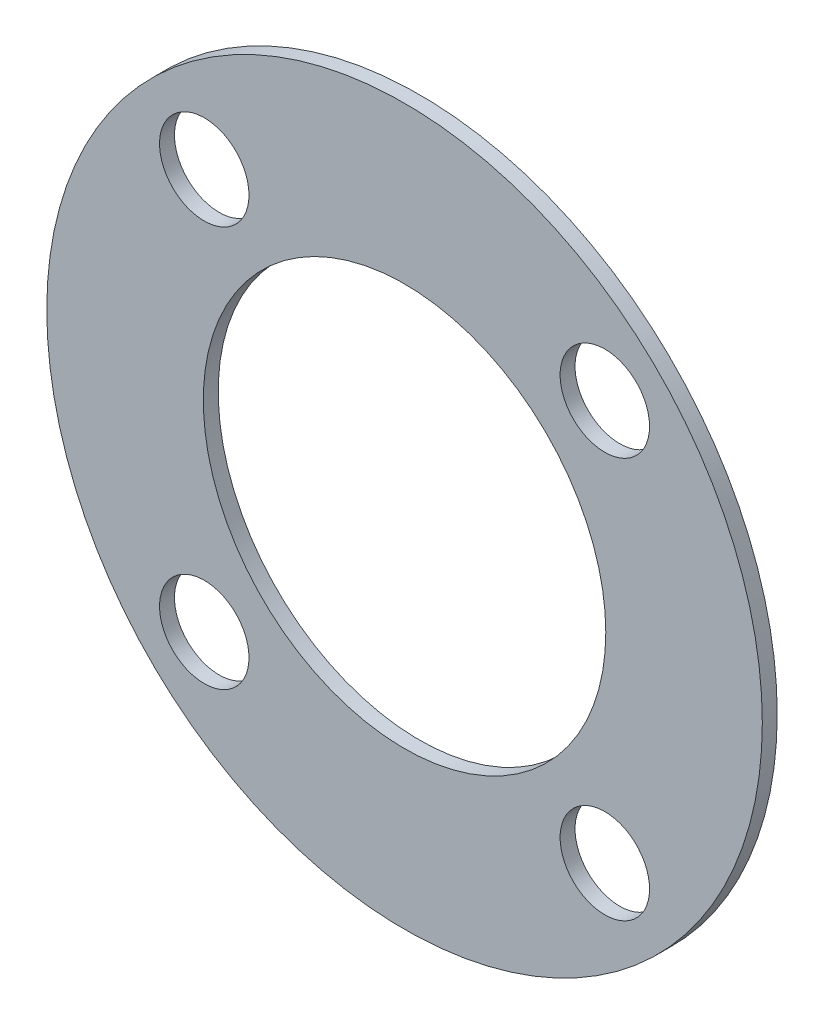
ISO-10303-21;
HEADER;
FILE_DESCRIPTION(('STEP AP214'),'2;1');
FILE_NAME('part.step','',(''),(''),'','','');
FILE_SCHEMA(('AUTOMOTIVE_DESIGN { 1 0 10303 214 1 1 1 1 }'));
ENDSEC;
DATA;
#1=APPLICATION_CONTEXT('core data for automotive mechanical design processes');
#2=APPLICATION_PROTOCOL_DEFINITION('international standard','automotive_design',2000,#1);
#3=PRODUCT_CONTEXT('',#1,'mechanical');
#4=PRODUCT('Part','Part','',(#3));
#5=PRODUCT_RELATED_PRODUCT_CATEGORY('part','',(#4));
#6=PRODUCT_DEFINITION_FORMATION('','',#4);
#7=PRODUCT_DEFINITION_CONTEXT('part definition',#1,'design');
#8=PRODUCT_DEFINITION('design','',#6,#7);
#9=PRODUCT_DEFINITION_SHAPE('','',#8);
#10=(LENGTH_UNIT() NAMED_UNIT(*) SI_UNIT(.MILLI.,.METRE.));
#11=(NAMED_UNIT(*) PLANE_ANGLE_UNIT() SI_UNIT($,.RADIAN.));
#12=(NAMED_UNIT(*) SI_UNIT($,.STERADIAN.) SOLID_ANGLE_UNIT());
#13=UNCERTAINTY_MEASURE_WITH_UNIT(LENGTH_MEASURE(1.E-05),#10,'distance_accuracy_value','');
#14=(GEOMETRIC_REPRESENTATION_CONTEXT(3) GLOBAL_UNCERTAINTY_ASSIGNED_CONTEXT((#13)) GLOBAL_UNIT_ASSIGNED_CONTEXT((#10,
#11,#12)) REPRESENTATION_CONTEXT('',''));
#15=CARTESIAN_POINT('',(0.,0.,0.));
#16=DIRECTION('',(0.,0.,1.));
#17=DIRECTION('',(1.,0.,0.));
#18=AXIS2_PLACEMENT_3D('',#15,#16,#17);
#19=CARTESIAN_POINT('',(0.,-201.6125,3.175));
#20=DIRECTION('',(0.,0.,1.));
#21=DIRECTION('',(1.,0.,0.));
#22=AXIS2_PLACEMENT_3D('',#19,#20,#21);
#23=PLANE('',#22);
#24=CARTESIAN_POINT('',(-42.6562165750784,-158.956283424921,3.175));
#25=DIRECTION('',(0.,0.,1.));
#26=DIRECTION('',(1.,0.,0.));
#27=AXIS2_PLACEMENT_3D('',#24,#25,#26);
#28=CIRCLE('',#27,9.525);
#29=CARTESIAN_POINT('',(-33.1312165750784,-158.956283424921,3.175));
#30=VERTEX_POINT('',#29);
#31=EDGE_CURVE('E64',#30,#30,#28,.T.);
#32=ORIENTED_EDGE('',*,*,#31,.F.);
#33=EDGE_LOOP('',(#32));
#34=FACE_BOUND('',#33,.T.);
#35=CARTESIAN_POINT('',(42.6562165750787,-244.268716575078,3.175));
#36=DIRECTION('',(0.,0.,1.));
#37=DIRECTION('',(1.,0.,0.));
#38=AXIS2_PLACEMENT_3D('',#35,#36,#37);
#39=CIRCLE('',#38,9.525);
#40=CARTESIAN_POINT('',(52.1812165750787,-244.268716575078,3.175));
#41=VERTEX_POINT('',#40);
#42=EDGE_CURVE('E52',#41,#41,#39,.T.);
#43=ORIENTED_EDGE('',*,*,#42,.F.);
#44=EDGE_LOOP('',(#43));
#45=FACE_BOUND('',#44,.T.);
#46=CARTESIAN_POINT('',(0.,-201.6125,3.175));
#47=DIRECTION('',(0.,0.,1.));
#48=DIRECTION('',(1.,0.,0.));
#49=AXIS2_PLACEMENT_3D('',#46,#47,#48);
#50=CIRCLE('',#49,76.2);
#51=CARTESIAN_POINT('',(76.2,-201.6125,3.175));
#52=VERTEX_POINT('',#51);
#53=EDGE_CURVE('E10',#52,#52,#50,.T.);
#54=ORIENTED_EDGE('',*,*,#53,.T.);
#55=EDGE_LOOP('',(#54));
#56=FACE_BOUND('',#55,.T.);
#57=CARTESIAN_POINT('',(0.,-201.6125,3.175));
#58=DIRECTION('',(0.,0.,1.));
#59=DIRECTION('',(1.,0.,0.));
#60=AXIS2_PLACEMENT_3D('',#57,#58,#59);
#61=CIRCLE('',#60,42.8625);
#62=CARTESIAN_POINT('',(42.8625,-201.6125,3.175));
#63=VERTEX_POINT('',#62);
#64=EDGE_CURVE('E43',#63,#63,#61,.T.);
#65=ORIENTED_EDGE('',*,*,#64,.F.);
#66=EDGE_LOOP('',(#65));
#67=FACE_BOUND('',#66,.T.);
#68=CARTESIAN_POINT('',(-42.6562165750784,-244.268716575079,3.175));
#69=DIRECTION('',(0.,0.,1.));
#70=DIRECTION('',(1.,0.,0.));
#71=AXIS2_PLACEMENT_3D('',#68,#69,#70);
#72=CIRCLE('',#71,9.52500000000001);
#73=CARTESIAN_POINT('',(-33.1312165750784,-244.268716575079,3.175));
#74=VERTEX_POINT('',#73);
#75=EDGE_CURVE('E58',#74,#74,#72,.T.);
#76=ORIENTED_EDGE('',*,*,#75,.F.);
#77=EDGE_LOOP('',(#76));
#78=FACE_BOUND('',#77,.T.);
#79=CARTESIAN_POINT('',(42.6562165750787,-158.956283424922,3.175));
#80=DIRECTION('',(0.,0.,1.));
#81=DIRECTION('',(1.,0.,0.));
#82=AXIS2_PLACEMENT_3D('',#79,#80,#81);
#83=CIRCLE('',#82,9.52500000000001);
#84=CARTESIAN_POINT('',(52.1812165750787,-158.956283424922,3.175));
#85=VERTEX_POINT('',#84);
#86=EDGE_CURVE('E70',#85,#85,#83,.T.);
#87=ORIENTED_EDGE('',*,*,#86,.F.);
#88=EDGE_LOOP('',(#87));
#89=FACE_BOUND('',#88,.T.);
#90=ADVANCED_FACE('F32',(#34,#45,#56,#67,#78,#89),#23,.T.);
#91=CARTESIAN_POINT('',(0.,-201.6125,0.));
#92=DIRECTION('',(0.,0.,1.));
#93=DIRECTION('',(1.,0.,0.));
#94=AXIS2_PLACEMENT_3D('',#91,#92,#93);
#95=PLANE('',#94);
#96=CARTESIAN_POINT('',(-42.6562165750784,-158.956283424921,0.));
#97=DIRECTION('',(0.,0.,1.));
#98=DIRECTION('',(1.,0.,0.));
#99=AXIS2_PLACEMENT_3D('',#96,#97,#98);
#100=CIRCLE('',#99,9.525);
#101=CARTESIAN_POINT('',(-33.1312165750784,-158.956283424921,0.));
#102=VERTEX_POINT('',#101);
#103=EDGE_CURVE('E67',#102,#102,#100,.T.);
#104=ORIENTED_EDGE('',*,*,#103,.T.);
#105=EDGE_LOOP('',(#104));
#106=FACE_BOUND('',#105,.T.);
#107=CARTESIAN_POINT('',(42.6562165750787,-244.268716575078,0.));
#108=DIRECTION('',(0.,0.,1.));
#109=DIRECTION('',(1.,0.,0.));
#110=AXIS2_PLACEMENT_3D('',#107,#108,#109);
#111=CIRCLE('',#110,9.525);
#112=CARTESIAN_POINT('',(52.1812165750787,-244.268716575078,0.));
#113=VERTEX_POINT('',#112);
#114=EDGE_CURVE('E55',#113,#113,#111,.T.);
#115=ORIENTED_EDGE('',*,*,#114,.T.);
#116=EDGE_LOOP('',(#115));
#117=FACE_BOUND('',#116,.T.);
#118=CARTESIAN_POINT('',(0.,-201.6125,0.));
#119=DIRECTION('',(0.,0.,1.));
#120=DIRECTION('',(1.,0.,0.));
#121=AXIS2_PLACEMENT_3D('',#118,#119,#120);
#122=CIRCLE('',#121,76.2);
#123=CARTESIAN_POINT('',(76.2,-201.6125,0.));
#124=VERTEX_POINT('',#123);
#125=EDGE_CURVE('E39',#124,#124,#122,.T.);
#126=ORIENTED_EDGE('',*,*,#125,.F.);
#127=EDGE_LOOP('',(#126));
#128=FACE_BOUND('',#127,.T.);
#129=CARTESIAN_POINT('',(0.,-201.6125,0.));
#130=DIRECTION('',(0.,0.,1.));
#131=DIRECTION('',(1.,0.,0.));
#132=AXIS2_PLACEMENT_3D('',#129,#130,#131);
#133=CIRCLE('',#132,42.8625);
#134=CARTESIAN_POINT('',(42.8625,-201.6125,0.));
#135=VERTEX_POINT('',#134);
#136=EDGE_CURVE('E47',#135,#135,#133,.T.);
#137=ORIENTED_EDGE('',*,*,#136,.T.);
#138=EDGE_LOOP('',(#137));
#139=FACE_BOUND('',#138,.T.);
#140=CARTESIAN_POINT('',(-42.6562165750784,-244.268716575079,0.));
#141=DIRECTION('',(0.,0.,1.));
#142=DIRECTION('',(1.,0.,0.));
#143=AXIS2_PLACEMENT_3D('',#140,#141,#142);
#144=CIRCLE('',#143,9.52500000000001);
#145=CARTESIAN_POINT('',(-33.1312165750784,-244.268716575079,0.));
#146=VERTEX_POINT('',#145);
#147=EDGE_CURVE('E61',#146,#146,#144,.T.);
#148=ORIENTED_EDGE('',*,*,#147,.T.);
#149=EDGE_LOOP('',(#148));
#150=FACE_BOUND('',#149,.T.);
#151=CARTESIAN_POINT('',(42.6562165750787,-158.956283424922,0.));
#152=DIRECTION('',(0.,0.,1.));
#153=DIRECTION('',(1.,0.,0.));
#154=AXIS2_PLACEMENT_3D('',#151,#152,#153);
#155=CIRCLE('',#154,9.52500000000001);
#156=CARTESIAN_POINT('',(52.1812165750787,-158.956283424922,0.));
#157=VERTEX_POINT('',#156);
#158=EDGE_CURVE('E73',#157,#157,#155,.T.);
#159=ORIENTED_EDGE('',*,*,#158,.T.);
#160=EDGE_LOOP('',(#159));
#161=FACE_BOUND('',#160,.T.);
#162=ADVANCED_FACE('F77',(#106,#117,#128,#139,#150,#161),#95,.F.);
#163=CARTESIAN_POINT('',(0.,-201.6125,3.175));
#164=DIRECTION('',(0.,0.,-1.));
#165=DIRECTION('',(-1.,0.,0.));
#166=AXIS2_PLACEMENT_3D('',#163,#164,#165);
#167=CYLINDRICAL_SURFACE('',#166,76.2);
#168=ORIENTED_EDGE('',*,*,#53,.F.);
#169=EDGE_LOOP('',(#168));
#170=FACE_BOUND('',#169,.T.);
#171=ORIENTED_EDGE('',*,*,#125,.T.);
#172=EDGE_LOOP('',(#171));
#173=FACE_BOUND('',#172,.T.);
#174=ADVANCED_FACE('F34',(#170,#173),#167,.T.);
#175=CARTESIAN_POINT('',(0.,-201.6125,3.175));
#176=DIRECTION('',(0.,0.,-1.));
#177=DIRECTION('',(-1.,0.,0.));
#178=AXIS2_PLACEMENT_3D('',#175,#176,#177);
#179=CYLINDRICAL_SURFACE('',#178,42.8625);
#180=ORIENTED_EDGE('',*,*,#64,.T.);
#181=EDGE_LOOP('',(#180));
#182=FACE_BOUND('',#181,.T.);
#183=ORIENTED_EDGE('',*,*,#136,.F.);
#184=EDGE_LOOP('',(#183));
#185=FACE_BOUND('',#184,.T.);
#186=ADVANCED_FACE('F100',(#182,#185),#179,.F.);
#187=CARTESIAN_POINT('',(42.6562165750787,-244.268716575078,3.175));
#188=DIRECTION('',(0.,0.,-1.));
#189=DIRECTION('',(-1.,0.,0.));
#190=AXIS2_PLACEMENT_3D('',#187,#188,#189);
#191=CYLINDRICAL_SURFACE('',#190,9.525);
#192=ORIENTED_EDGE('',*,*,#42,.T.);
#193=EDGE_LOOP('',(#192));
#194=FACE_BOUND('',#193,.T.);
#195=ORIENTED_EDGE('',*,*,#114,.F.);
#196=EDGE_LOOP('',(#195));
#197=FACE_BOUND('',#196,.T.);
#198=ADVANCED_FACE('F103',(#194,#197),#191,.F.);
#199=CARTESIAN_POINT('',(-42.6562165750784,-244.268716575079,3.175));
#200=DIRECTION('',(0.,0.,-1.));
#201=DIRECTION('',(-1.,0.,0.));
#202=AXIS2_PLACEMENT_3D('',#199,#200,#201);
#203=CYLINDRICAL_SURFACE('',#202,9.52500000000001);
#204=ORIENTED_EDGE('',*,*,#75,.T.);
#205=EDGE_LOOP('',(#204));
#206=FACE_BOUND('',#205,.T.);
#207=ORIENTED_EDGE('',*,*,#147,.F.);
#208=EDGE_LOOP('',(#207));
#209=FACE_BOUND('',#208,.T.);
#210=ADVANCED_FACE('F87',(#206,#209),#203,.F.);
#211=CARTESIAN_POINT('',(-42.6562165750784,-158.956283424921,3.175));
#212=DIRECTION('',(0.,0.,-1.));
#213=DIRECTION('',(-1.,0.,0.));
#214=AXIS2_PLACEMENT_3D('',#211,#212,#213);
#215=CYLINDRICAL_SURFACE('',#214,9.525);
#216=ORIENTED_EDGE('',*,*,#31,.T.);
#217=EDGE_LOOP('',(#216));
#218=FACE_BOUND('',#217,.T.);
#219=ORIENTED_EDGE('',*,*,#103,.F.);
#220=EDGE_LOOP('',(#219));
#221=FACE_BOUND('',#220,.T.);
#222=ADVANCED_FACE('F81',(#218,#221),#215,.F.);
#223=CARTESIAN_POINT('',(42.6562165750787,-158.956283424922,3.175));
#224=DIRECTION('',(0.,0.,-1.));
#225=DIRECTION('',(-1.,0.,0.));
#226=AXIS2_PLACEMENT_3D('',#223,#224,#225);
#227=CYLINDRICAL_SURFACE('',#226,9.52500000000001);
#228=ORIENTED_EDGE('',*,*,#86,.T.);
#229=EDGE_LOOP('',(#228));
#230=FACE_BOUND('',#229,.T.);
#231=ORIENTED_EDGE('',*,*,#158,.F.);
#232=EDGE_LOOP('',(#231));
#233=FACE_BOUND('',#232,.T.);
#234=ADVANCED_FACE('F79',(#230,#233),#227,.F.);
#235=CLOSED_SHELL('',(#90,#162,#174,#186,#198,#210,#222,#234));
#236=MANIFOLD_SOLID_BREP('B2',#235);
#237=ADVANCED_BREP_SHAPE_REPRESENTATION('',(#18,#236),#14);
#238=SHAPE_DEFINITION_REPRESENTATION(#9,#237);
ENDSEC;
END-ISO-10303-21;
